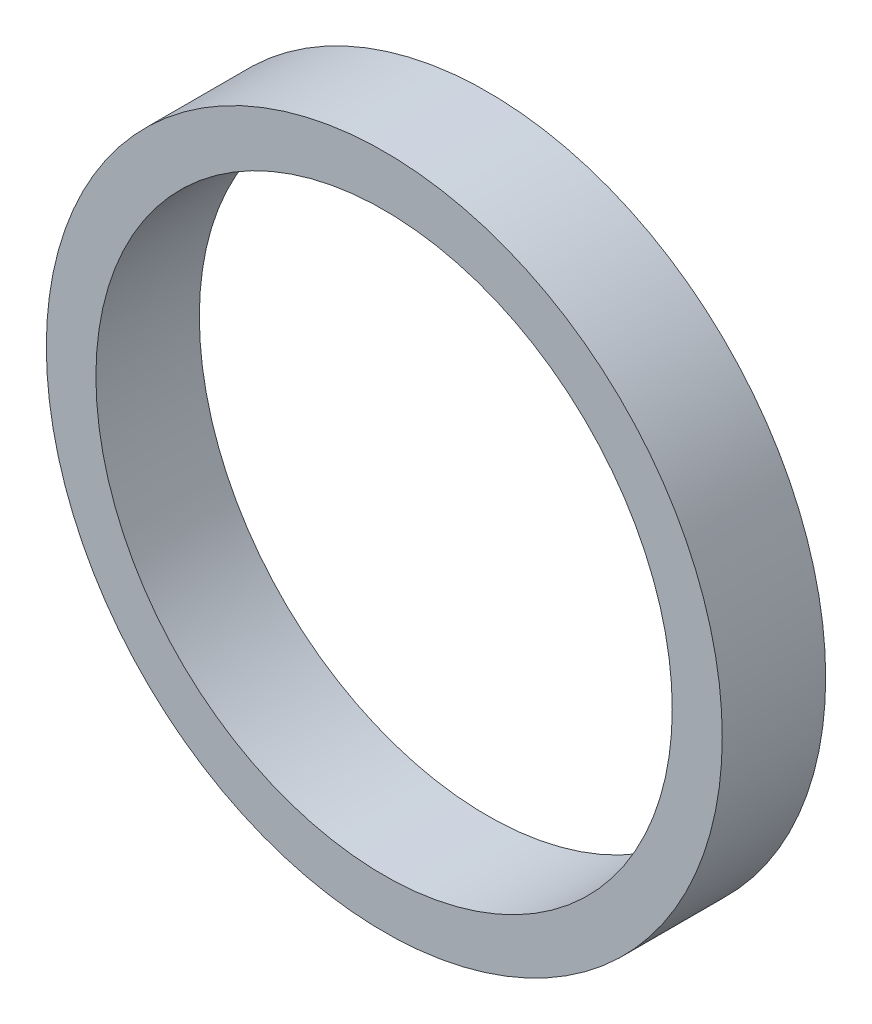
ISO-10303-21;
HEADER;
FILE_DESCRIPTION(('STEP AP214'),'2;1');
FILE_NAME('part.step','',(''),(''),'','','');
FILE_SCHEMA(('AUTOMOTIVE_DESIGN { 1 0 10303 214 1 1 1 1 }'));
ENDSEC;
DATA;
#1=APPLICATION_CONTEXT('core data for automotive mechanical design processes');
#2=APPLICATION_PROTOCOL_DEFINITION('international standard','automotive_design',2000,#1);
#3=PRODUCT_CONTEXT('',#1,'mechanical');
#4=PRODUCT('Part','Part','',(#3));
#5=PRODUCT_RELATED_PRODUCT_CATEGORY('part','',(#4));
#6=PRODUCT_DEFINITION_FORMATION('','',#4);
#7=PRODUCT_DEFINITION_CONTEXT('part definition',#1,'design');
#8=PRODUCT_DEFINITION('design','',#6,#7);
#9=PRODUCT_DEFINITION_SHAPE('','',#8);
#10=(LENGTH_UNIT() NAMED_UNIT(*) SI_UNIT(.MILLI.,.METRE.));
#11=(NAMED_UNIT(*) PLANE_ANGLE_UNIT() SI_UNIT($,.RADIAN.));
#12=(NAMED_UNIT(*) SI_UNIT($,.STERADIAN.) SOLID_ANGLE_UNIT());
#13=UNCERTAINTY_MEASURE_WITH_UNIT(LENGTH_MEASURE(1.E-05),#10,'distance_accuracy_value','');
#14=(GEOMETRIC_REPRESENTATION_CONTEXT(3) GLOBAL_UNCERTAINTY_ASSIGNED_CONTEXT((#13)) GLOBAL_UNIT_ASSIGNED_CONTEXT((#10,
#11,#12)) REPRESENTATION_CONTEXT('',''));
#15=CARTESIAN_POINT('',(0.,0.,0.));
#16=DIRECTION('',(0.,0.,1.));
#17=DIRECTION('',(1.,0.,0.));
#18=AXIS2_PLACEMENT_3D('',#15,#16,#17);
#19=CARTESIAN_POINT('',(15.9973930567503,15.989450737834,9.68));
#20=DIRECTION('',(0.,0.,-1.));
#21=DIRECTION('',(-1.,0.,0.));
#22=AXIS2_PLACEMENT_3D('',#19,#20,#21);
#23=CYLINDRICAL_SURFACE('',#22,3.5388399);
#24=CARTESIAN_POINT('',(15.9973930567503,15.989450737834,10.95));
#25=DIRECTION('',(0.,0.,-1.));
#26=DIRECTION('',(-1.,0.,0.));
#27=AXIS2_PLACEMENT_3D('',#24,#25,#26);
#28=CIRCLE('',#27,3.5388399);
#29=CARTESIAN_POINT('',(12.4585531567503,15.989450737834,10.95));
#30=VERTEX_POINT('',#29);
#31=EDGE_CURVE('E27',#30,#30,#28,.T.);
#32=ORIENTED_EDGE('',*,*,#31,.F.);
#33=EDGE_LOOP('',(#32));
#34=FACE_BOUND('',#33,.T.);
#35=CARTESIAN_POINT('',(15.9973930567503,15.989450737834,9.68));
#36=DIRECTION('',(0.,0.,-1.));
#37=DIRECTION('',(-1.,0.,0.));
#38=AXIS2_PLACEMENT_3D('',#35,#36,#37);
#39=CIRCLE('',#38,3.5388399);
#40=CARTESIAN_POINT('',(12.4585531567503,15.989450737834,9.68));
#41=VERTEX_POINT('',#40);
#42=EDGE_CURVE('E18',#41,#41,#39,.T.);
#43=ORIENTED_EDGE('',*,*,#42,.T.);
#44=EDGE_LOOP('',(#43));
#45=FACE_BOUND('',#44,.T.);
#46=ADVANCED_FACE('F15',(#34,#45),#23,.F.);
#47=CARTESIAN_POINT('',(28.00000000001,16.000000000005,9.68));
#48=DIRECTION('',(0.,0.,1.));
#49=DIRECTION('',(1.,0.,0.));
#50=AXIS2_PLACEMENT_3D('',#47,#48,#49);
#51=PLANE('',#50);
#52=CARTESIAN_POINT('',(16.,16.,9.68));
#53=DIRECTION('',(0.,0.,-1.));
#54=DIRECTION('',(-1.,0.,0.));
#55=AXIS2_PLACEMENT_3D('',#52,#53,#54);
#56=CIRCLE('',#55,4.1503195);
#57=CARTESIAN_POINT('',(11.8496805,16.,9.68));
#58=VERTEX_POINT('',#57);
#59=EDGE_CURVE('E22',#58,#58,#56,.F.);
#60=ORIENTED_EDGE('',*,*,#59,.F.);
#61=EDGE_LOOP('',(#60));
#62=FACE_BOUND('',#61,.T.);
#63=ORIENTED_EDGE('',*,*,#42,.F.);
#64=EDGE_LOOP('',(#63));
#65=FACE_BOUND('',#64,.T.);
#66=ADVANCED_FACE('F36',(#62,#65),#51,.F.);
#67=CARTESIAN_POINT('',(28.00000000001,16.000000000005,10.95));
#68=DIRECTION('',(0.,0.,1.));
#69=DIRECTION('',(1.,0.,0.));
#70=AXIS2_PLACEMENT_3D('',#67,#68,#69);
#71=PLANE('',#70);
#72=CARTESIAN_POINT('',(16.,16.,10.95));
#73=DIRECTION('',(0.,0.,-1.));
#74=DIRECTION('',(-1.,0.,0.));
#75=AXIS2_PLACEMENT_3D('',#72,#73,#74);
#76=CIRCLE('',#75,4.1503195);
#77=CARTESIAN_POINT('',(11.8496805,16.,10.95));
#78=VERTEX_POINT('',#77);
#79=EDGE_CURVE('E10',#78,#78,#76,.T.);
#80=ORIENTED_EDGE('',*,*,#79,.F.);
#81=EDGE_LOOP('',(#80));
#82=FACE_BOUND('',#81,.T.);
#83=ORIENTED_EDGE('',*,*,#31,.T.);
#84=EDGE_LOOP('',(#83));
#85=FACE_BOUND('',#84,.T.);
#86=ADVANCED_FACE('F38',(#82,#85),#71,.T.);
#87=CARTESIAN_POINT('',(16.,16.,9.68));
#88=DIRECTION('',(0.,0.,-1.));
#89=DIRECTION('',(-1.,0.,0.));
#90=AXIS2_PLACEMENT_3D('',#87,#88,#89);
#91=CYLINDRICAL_SURFACE('',#90,4.1503195);
#92=ORIENTED_EDGE('',*,*,#79,.T.);
#93=EDGE_LOOP('',(#92));
#94=FACE_BOUND('',#93,.T.);
#95=ORIENTED_EDGE('',*,*,#59,.T.);
#96=EDGE_LOOP('',(#95));
#97=FACE_BOUND('',#96,.T.);
#98=ADVANCED_FACE('F45',(#94,#97),#91,.T.);
#99=CLOSED_SHELL('',(#46,#66,#86,#98));
#100=MANIFOLD_SOLID_BREP('B1',#99);
#101=ADVANCED_BREP_SHAPE_REPRESENTATION('',(#18,#100),#14);
#102=SHAPE_DEFINITION_REPRESENTATION(#9,#101);
ENDSEC;
END-ISO-10303-21;
